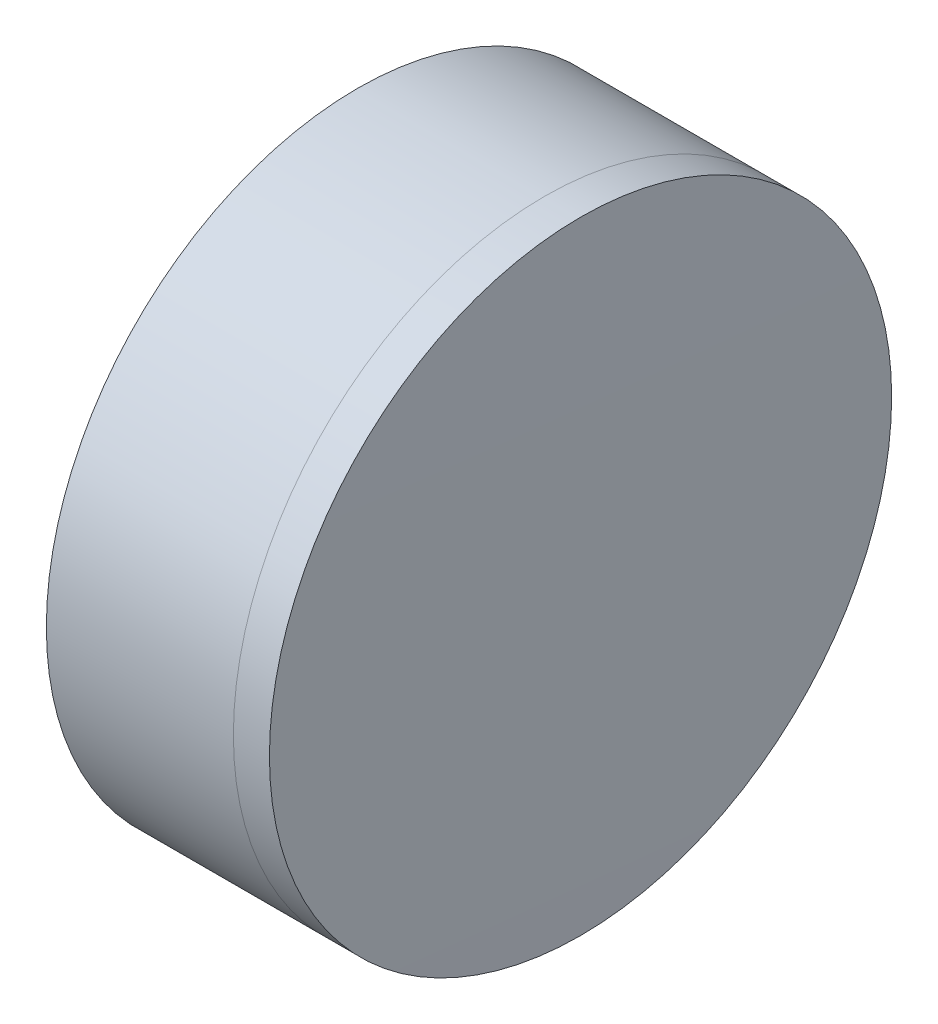
ISO-10303-21;
HEADER;
FILE_DESCRIPTION(('STEP AP214'),'2;1');
FILE_NAME('part.step','',(''),(''),'','','');
FILE_SCHEMA(('AUTOMOTIVE_DESIGN { 1 0 10303 214 1 1 1 1 }'));
ENDSEC;
DATA;
#1=APPLICATION_CONTEXT('core data for automotive mechanical design processes');
#2=APPLICATION_PROTOCOL_DEFINITION('international standard','automotive_design',2000,#1);
#3=PRODUCT_CONTEXT('',#1,'mechanical');
#4=PRODUCT('Part','Part','',(#3));
#5=PRODUCT_RELATED_PRODUCT_CATEGORY('part','',(#4));
#6=PRODUCT_DEFINITION_FORMATION('','',#4);
#7=PRODUCT_DEFINITION_CONTEXT('part definition',#1,'design');
#8=PRODUCT_DEFINITION('design','',#6,#7);
#9=PRODUCT_DEFINITION_SHAPE('','',#8);
#10=(LENGTH_UNIT() NAMED_UNIT(*) SI_UNIT(.MILLI.,.METRE.));
#11=(NAMED_UNIT(*) PLANE_ANGLE_UNIT() SI_UNIT($,.RADIAN.));
#12=(NAMED_UNIT(*) SI_UNIT($,.STERADIAN.) SOLID_ANGLE_UNIT());
#13=UNCERTAINTY_MEASURE_WITH_UNIT(LENGTH_MEASURE(1.E-05),#10,'distance_accuracy_value','');
#14=(GEOMETRIC_REPRESENTATION_CONTEXT(3) GLOBAL_UNCERTAINTY_ASSIGNED_CONTEXT((#13)) GLOBAL_UNIT_ASSIGNED_CONTEXT((#10,
#11,#12)) REPRESENTATION_CONTEXT('',''));
#15=CARTESIAN_POINT('',(0.,0.,0.));
#16=DIRECTION('',(0.,0.,1.));
#17=DIRECTION('',(1.,0.,0.));
#18=AXIS2_PLACEMENT_3D('',#15,#16,#17);
#19=CARTESIAN_POINT('',(186.338791314652,0.,0.));
#20=DIRECTION('',(-1.,0.,0.));
#21=DIRECTION('',(0.,0.,1.));
#22=AXIS2_PLACEMENT_3D('',#19,#20,#21);
#23=SPHERICAL_SURFACE('',#22,33.91);
#24=CARTESIAN_POINT('',(154.896811415161,0.,0.));
#25=DIRECTION('',(-1.,0.,0.));
#26=DIRECTION('',(0.,0.,1.));
#27=AXIS2_PLACEMENT_3D('',#24,#25,#26);
#28=CIRCLE('',#27,12.6999999999999);
#29=CARTESIAN_POINT('',(154.896811415161,0.,12.6999999999999));
#30=VERTEX_POINT('',#29);
#31=EDGE_CURVE('E11',#30,#30,#28,.T.);
#32=ORIENTED_EDGE('',*,*,#31,.T.);
#33=EDGE_LOOP('',(#32));
#34=FACE_BOUND('',#33,.T.);
#35=ADVANCED_FACE('F45',(#34),#23,.T.);
#36=CARTESIAN_POINT('',(147.262101386751,0.,0.));
#37=DIRECTION('',(-1.,0.,0.));
#38=DIRECTION('',(0.,0.,1.));
#39=AXIS2_PLACEMENT_3D('',#36,#37,#38);
#40=CYLINDRICAL_SURFACE('',#39,12.6999999999999);
#41=CARTESIAN_POINT('',(156.368177382278,0.,0.));
#42=DIRECTION('',(-1.,0.,0.));
#43=DIRECTION('',(0.,0.,1.));
#44=AXIS2_PLACEMENT_3D('',#41,#42,#43);
#45=CIRCLE('',#44,12.6999999999999);
#46=CARTESIAN_POINT('',(156.368177382278,0.,12.6999999999999));
#47=VERTEX_POINT('',#46);
#48=EDGE_CURVE('E51',#47,#47,#45,.T.);
#49=ORIENTED_EDGE('',*,*,#48,.T.);
#50=EDGE_LOOP('',(#49));
#51=FACE_BOUND('',#50,.T.);
#52=ORIENTED_EDGE('',*,*,#31,.F.);
#53=EDGE_LOOP('',(#52));
#54=FACE_BOUND('',#53,.T.);
#55=ADVANCED_FACE('F57',(#51,#54),#40,.T.);
#56=CARTESIAN_POINT('',(-1174.07120868535,0.,0.));
#57=DIRECTION('',(-1.,0.,0.));
#58=DIRECTION('',(0.,0.,1.));
#59=AXIS2_PLACEMENT_3D('',#56,#57,#58);
#60=SPHERICAL_SURFACE('',#59,1330.5);
#61=ORIENTED_EDGE('',*,*,#48,.F.);
#62=EDGE_LOOP('',(#61));
#63=FACE_BOUND('',#62,.T.);
#64=ADVANCED_FACE('F60',(#63),#60,.T.);
#65=CLOSED_SHELL('',(#35,#55,#64));
#66=MANIFOLD_SOLID_BREP('B2',#65);
#67=CARTESIAN_POINT('',(123.378791314652,0.,0.));
#68=DIRECTION('',(-1.,0.,0.));
#69=DIRECTION('',(0.,0.,1.));
#70=AXIS2_PLACEMENT_3D('',#67,#68,#69);
#71=SPHERICAL_SURFACE('',#70,27.05);
#72=CARTESIAN_POINT('',(147.262101386751,0.,0.));
#73=DIRECTION('',(-1.,0.,0.));
#74=DIRECTION('',(0.,0.,1.));
#75=AXIS2_PLACEMENT_3D('',#72,#73,#74);
#76=CIRCLE('',#75,12.7);
#77=CARTESIAN_POINT('',(147.262101386751,0.,12.6999999999999));
#78=VERTEX_POINT('',#77);
#79=EDGE_CURVE('E44',#78,#78,#76,.T.);
#80=ORIENTED_EDGE('',*,*,#79,.T.);
#81=EDGE_LOOP('',(#80));
#82=FACE_BOUND('',#81,.T.);
#83=ADVANCED_FACE('F86',(#82),#71,.F.);
#84=CARTESIAN_POINT('',(-185.274474050658,0.,0.));
#85=DIRECTION('',(-1.,0.,0.));
#86=DIRECTION('',(0.,0.,1.));
#87=AXIS2_PLACEMENT_3D('',#84,#85,#86);
#88=CYLINDRICAL_SURFACE('',#87,12.7);
#89=CARTESIAN_POINT('',(154.896811415161,0.,0.));
#90=DIRECTION('',(-1.,0.,0.));
#91=DIRECTION('',(0.,0.,1.));
#92=AXIS2_PLACEMENT_3D('',#89,#90,#91);
#93=CIRCLE('',#92,12.7);
#94=CARTESIAN_POINT('',(154.896811415161,0.,12.6999999999999));
#95=VERTEX_POINT('',#94);
#96=EDGE_CURVE('E92',#95,#95,#93,.T.);
#97=ORIENTED_EDGE('',*,*,#96,.T.);
#98=EDGE_LOOP('',(#97));
#99=FACE_BOUND('',#98,.T.);
#100=ORIENTED_EDGE('',*,*,#79,.F.);
#101=EDGE_LOOP('',(#100));
#102=FACE_BOUND('',#101,.T.);
#103=ADVANCED_FACE('F98',(#99,#102),#88,.T.);
#104=CARTESIAN_POINT('',(186.338791314652,0.,0.));
#105=DIRECTION('',(-1.,0.,0.));
#106=DIRECTION('',(0.,0.,1.));
#107=AXIS2_PLACEMENT_3D('',#104,#105,#106);
#108=SPHERICAL_SURFACE('',#107,33.91);
#109=ORIENTED_EDGE('',*,*,#96,.F.);
#110=EDGE_LOOP('',(#109));
#111=FACE_BOUND('',#110,.T.);
#112=ADVANCED_FACE('F101',(#111),#108,.F.);
#113=CLOSED_SHELL('',(#83,#103,#112));
#114=MANIFOLD_SOLID_BREP('B6',#113);
#115=ADVANCED_BREP_SHAPE_REPRESENTATION('',(#18,#66,#114),#14);
#116=SHAPE_DEFINITION_REPRESENTATION(#9,#115);
ENDSEC;
END-ISO-10303-21;
